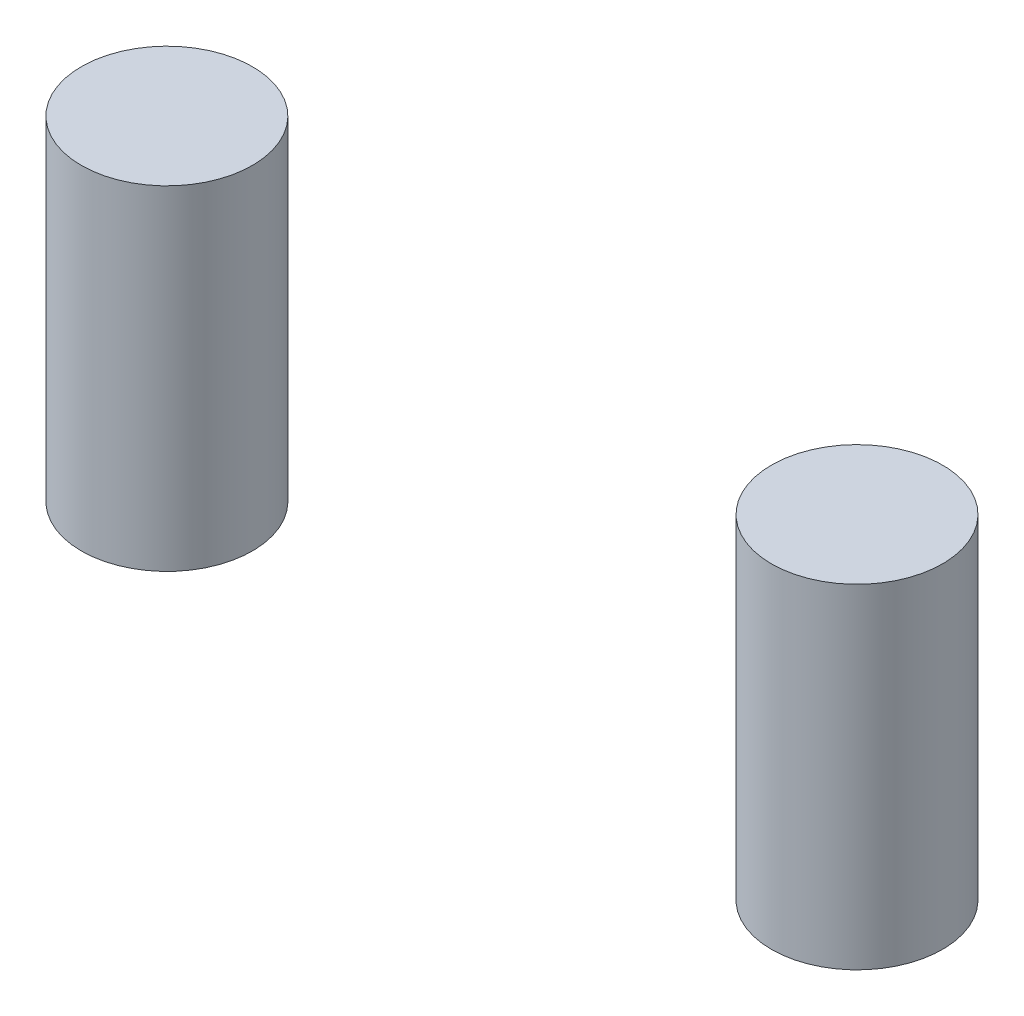
ISO-10303-21;
HEADER;
FILE_DESCRIPTION(('STEP AP214'),'2;1');
FILE_NAME('part.step','',(''),(''),'','','');
FILE_SCHEMA(('AUTOMOTIVE_DESIGN { 1 0 10303 214 1 1 1 1 }'));
ENDSEC;
DATA;
#1=APPLICATION_CONTEXT('core data for automotive mechanical design processes');
#2=APPLICATION_PROTOCOL_DEFINITION('international standard','automotive_design',2000,#1);
#3=PRODUCT_CONTEXT('',#1,'mechanical');
#4=PRODUCT('Part','Part','',(#3));
#5=PRODUCT_RELATED_PRODUCT_CATEGORY('part','',(#4));
#6=PRODUCT_DEFINITION_FORMATION('','',#4);
#7=PRODUCT_DEFINITION_CONTEXT('part definition',#1,'design');
#8=PRODUCT_DEFINITION('design','',#6,#7);
#9=PRODUCT_DEFINITION_SHAPE('','',#8);
#10=(LENGTH_UNIT() NAMED_UNIT(*) SI_UNIT(.MILLI.,.METRE.));
#11=(NAMED_UNIT(*) PLANE_ANGLE_UNIT() SI_UNIT($,.RADIAN.));
#12=(NAMED_UNIT(*) SI_UNIT($,.STERADIAN.) SOLID_ANGLE_UNIT());
#13=UNCERTAINTY_MEASURE_WITH_UNIT(LENGTH_MEASURE(1.E-05),#10,'distance_accuracy_value','');
#14=(GEOMETRIC_REPRESENTATION_CONTEXT(3) GLOBAL_UNCERTAINTY_ASSIGNED_CONTEXT((#13)) GLOBAL_UNIT_ASSIGNED_CONTEXT((#10,
#11,#12)) REPRESENTATION_CONTEXT('',''));
#15=CARTESIAN_POINT('',(0.,0.,0.));
#16=DIRECTION('',(0.,0.,1.));
#17=DIRECTION('',(1.,0.,0.));
#18=AXIS2_PLACEMENT_3D('',#15,#16,#17);
#19=CARTESIAN_POINT('',(27.8999994277954,12.,3.09999990463257));
#20=DIRECTION('',(0.,-1.,0.));
#21=DIRECTION('',(0.,0.,-1.));
#22=AXIS2_PLACEMENT_3D('',#19,#20,#21);
#23=CYLINDRICAL_SURFACE('',#22,3.075);
#24=CARTESIAN_POINT('',(27.8999994277954,12.,3.09999990463257));
#25=DIRECTION('',(0.,1.,0.));
#26=DIRECTION('',(0.,0.,1.));
#27=AXIS2_PLACEMENT_3D('',#24,#25,#26);
#28=CIRCLE('',#27,3.075);
#29=CARTESIAN_POINT('',(27.8999994277954,12.,6.17499990463257));
#30=VERTEX_POINT('',#29);
#31=EDGE_CURVE('E55',#30,#30,#28,.T.);
#32=ORIENTED_EDGE('',*,*,#31,.F.);
#33=EDGE_LOOP('',(#32));
#34=FACE_BOUND('',#33,.T.);
#35=CARTESIAN_POINT('',(27.8999994277954,0.,3.09999990463257));
#36=DIRECTION('',(0.,1.,0.));
#37=DIRECTION('',(0.,0.,1.));
#38=AXIS2_PLACEMENT_3D('',#35,#36,#37);
#39=CIRCLE('',#38,3.075);
#40=CARTESIAN_POINT('',(27.8999994277954,0.,6.17499990463257));
#41=VERTEX_POINT('',#40);
#42=EDGE_CURVE('E11',#41,#41,#39,.T.);
#43=ORIENTED_EDGE('',*,*,#42,.T.);
#44=EDGE_LOOP('',(#43));
#45=FACE_BOUND('',#44,.T.);
#46=ADVANCED_FACE('F51',(#34,#45),#23,.T.);
#47=CARTESIAN_POINT('',(27.8999994277954,12.,3.09999990463257));
#48=DIRECTION('',(0.,1.,0.));
#49=DIRECTION('',(0.,0.,1.));
#50=AXIS2_PLACEMENT_3D('',#47,#48,#49);
#51=PLANE('',#50);
#52=ORIENTED_EDGE('',*,*,#31,.T.);
#53=EDGE_LOOP('',(#52));
#54=FACE_BOUND('',#53,.T.);
#55=ADVANCED_FACE('F53',(#54),#51,.T.);
#56=CARTESIAN_POINT('',(27.8999994277954,0.,3.09999990463257));
#57=DIRECTION('',(0.,1.,0.));
#58=DIRECTION('',(0.,0.,1.));
#59=AXIS2_PLACEMENT_3D('',#56,#57,#58);
#60=PLANE('',#59);
#61=ORIENTED_EDGE('',*,*,#42,.F.);
#62=EDGE_LOOP('',(#61));
#63=FACE_BOUND('',#62,.T.);
#64=ADVANCED_FACE('F70',(#63),#60,.F.);
#65=CLOSED_SHELL('',(#46,#55,#64));
#66=MANIFOLD_SOLID_BREP('B2',#65);
#67=CARTESIAN_POINT('',(3.09999942779541,12.,3.09999990463257));
#68=DIRECTION('',(0.,-1.,0.));
#69=DIRECTION('',(0.,0.,-1.));
#70=AXIS2_PLACEMENT_3D('',#67,#68,#69);
#71=CYLINDRICAL_SURFACE('',#70,3.075);
#72=CARTESIAN_POINT('',(3.09999942779541,12.,3.09999990463257));
#73=DIRECTION('',(0.,1.,0.));
#74=DIRECTION('',(0.,0.,1.));
#75=AXIS2_PLACEMENT_3D('',#72,#73,#74);
#76=CIRCLE('',#75,3.075);
#77=CARTESIAN_POINT('',(3.09999942779541,12.,6.17499990463257));
#78=VERTEX_POINT('',#77);
#79=EDGE_CURVE('E50',#78,#78,#76,.T.);
#80=ORIENTED_EDGE('',*,*,#79,.F.);
#81=EDGE_LOOP('',(#80));
#82=FACE_BOUND('',#81,.T.);
#83=CARTESIAN_POINT('',(3.09999942779541,0.,3.09999990463257));
#84=DIRECTION('',(0.,1.,0.));
#85=DIRECTION('',(0.,0.,1.));
#86=AXIS2_PLACEMENT_3D('',#83,#84,#85);
#87=CIRCLE('',#86,3.075);
#88=CARTESIAN_POINT('',(3.09999942779541,0.,6.17499990463257));
#89=VERTEX_POINT('',#88);
#90=EDGE_CURVE('E95',#89,#89,#87,.T.);
#91=ORIENTED_EDGE('',*,*,#90,.T.);
#92=EDGE_LOOP('',(#91));
#93=FACE_BOUND('',#92,.T.);
#94=ADVANCED_FACE('F92',(#82,#93),#71,.T.);
#95=CARTESIAN_POINT('',(3.09999942779541,12.,3.09999990463257));
#96=DIRECTION('',(0.,1.,0.));
#97=DIRECTION('',(0.,0.,1.));
#98=AXIS2_PLACEMENT_3D('',#95,#96,#97);
#99=PLANE('',#98);
#100=ORIENTED_EDGE('',*,*,#79,.T.);
#101=EDGE_LOOP('',(#100));
#102=FACE_BOUND('',#101,.T.);
#103=ADVANCED_FACE('F109',(#102),#99,.T.);
#104=CARTESIAN_POINT('',(3.09999942779541,0.,3.09999990463257));
#105=DIRECTION('',(0.,1.,0.));
#106=DIRECTION('',(0.,0.,1.));
#107=AXIS2_PLACEMENT_3D('',#104,#105,#106);
#108=PLANE('',#107);
#109=ORIENTED_EDGE('',*,*,#90,.F.);
#110=EDGE_LOOP('',(#109));
#111=FACE_BOUND('',#110,.T.);
#112=ADVANCED_FACE('F107',(#111),#108,.F.);
#113=CLOSED_SHELL('',(#94,#103,#112));
#114=MANIFOLD_SOLID_BREP('B6',#113);
#115=ADVANCED_BREP_SHAPE_REPRESENTATION('',(#18,#66,#114),#14);
#116=SHAPE_DEFINITION_REPRESENTATION(#9,#115);
ENDSEC;
END-ISO-10303-21;
